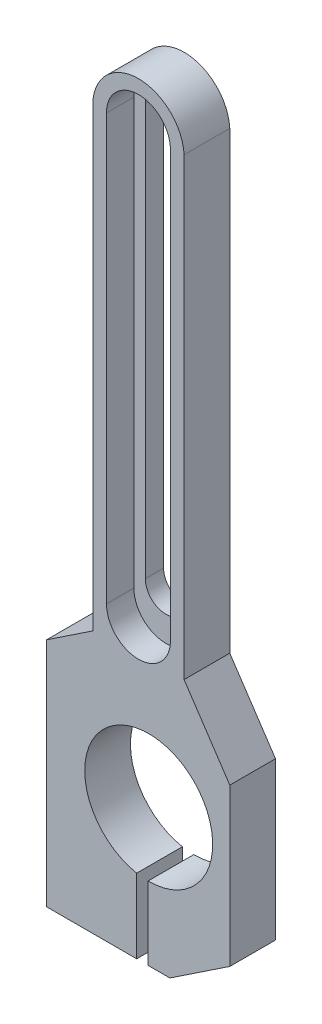
ISO-10303-21;
HEADER;
FILE_DESCRIPTION(('STEP AP214'),'2;1');
FILE_NAME('part.step','',(''),(''),'','','');
FILE_SCHEMA(('AUTOMOTIVE_DESIGN { 1 0 10303 214 1 1 1 1 }'));
ENDSEC;
DATA;
#1=APPLICATION_CONTEXT('core data for automotive mechanical design processes');
#2=APPLICATION_PROTOCOL_DEFINITION('international standard','automotive_design',2000,#1);
#3=PRODUCT_CONTEXT('',#1,'mechanical');
#4=PRODUCT('Part','Part','',(#3));
#5=PRODUCT_RELATED_PRODUCT_CATEGORY('part','',(#4));
#6=PRODUCT_DEFINITION_FORMATION('','',#4);
#7=PRODUCT_DEFINITION_CONTEXT('part definition',#1,'design');
#8=PRODUCT_DEFINITION('design','',#6,#7);
#9=PRODUCT_DEFINITION_SHAPE('','',#8);
#10=(LENGTH_UNIT() NAMED_UNIT(*) SI_UNIT(.MILLI.,.METRE.));
#11=(NAMED_UNIT(*) PLANE_ANGLE_UNIT() SI_UNIT($,.RADIAN.));
#12=(NAMED_UNIT(*) SI_UNIT($,.STERADIAN.) SOLID_ANGLE_UNIT());
#13=UNCERTAINTY_MEASURE_WITH_UNIT(LENGTH_MEASURE(1.E-05),#10,'distance_accuracy_value','');
#14=(GEOMETRIC_REPRESENTATION_CONTEXT(3) GLOBAL_UNCERTAINTY_ASSIGNED_CONTEXT((#13)) GLOBAL_UNIT_ASSIGNED_CONTEXT((#10,
#11,#12)) REPRESENTATION_CONTEXT('',''));
#15=CARTESIAN_POINT('',(0.,0.,0.));
#16=DIRECTION('',(0.,0.,1.));
#17=DIRECTION('',(1.,0.,0.));
#18=AXIS2_PLACEMENT_3D('',#15,#16,#17);
#19=CARTESIAN_POINT('',(-3.67997718197373,-54.5349544071179,10.));
#20=DIRECTION('',(0.,1.,0.));
#21=DIRECTION('',(0.,0.,1.));
#22=AXIS2_PLACEMENT_3D('',#19,#20,#21);
#23=PLANE('',#22);
#24=DIRECTION('',(1.,0.,0.));
#25=VECTOR('',#24,1.);
#26=CARTESIAN_POINT('',(-22.3649387441576,-54.5349544071179,10.));
#27=LINE('',#26,#25);
#28=CARTESIAN_POINT('',(-0.142672818562061,-54.5349544071179,10.));
#29=VERTEX_POINT('',#28);
#30=CARTESIAN_POINT('',(4.62817072668689,-54.5349544071179,10.));
#31=VERTEX_POINT('',#30);
#32=EDGE_CURVE('E193',#29,#31,#27,.T.);
#33=ORIENTED_EDGE('',*,*,#32,.F.);
#34=DIRECTION('',(0.,0.,-1.));
#35=VECTOR('',#34,1.);
#36=CARTESIAN_POINT('',(-0.142672818562061,-54.5349544071179,10.));
#37=LINE('',#36,#35);
#38=CARTESIAN_POINT('',(-0.142672818562061,-54.5349544071179,0.));
#39=VERTEX_POINT('',#38);
#40=EDGE_CURVE('E180',#29,#39,#37,.T.);
#41=ORIENTED_EDGE('',*,*,#40,.T.);
#42=DIRECTION('',(1.,0.,0.));
#43=VECTOR('',#42,1.);
#44=CARTESIAN_POINT('',(-3.67997718197373,-54.5349544071179,0.));
#45=LINE('',#44,#43);
#46=CARTESIAN_POINT('',(4.62817072668689,-54.5349544071179,0.));
#47=VERTEX_POINT('',#46);
#48=EDGE_CURVE('E247',#39,#47,#45,.T.);
#49=ORIENTED_EDGE('',*,*,#48,.T.);
#50=DIRECTION('',(0.,0.,-1.));
#51=VECTOR('',#50,1.);
#52=CARTESIAN_POINT('',(4.62817072668689,-54.5349544071179,10.));
#53=LINE('',#52,#51);
#54=EDGE_CURVE('E201',#31,#47,#53,.T.);
#55=ORIENTED_EDGE('',*,*,#54,.F.);
#56=EDGE_LOOP('',(#33,#41,#49,#55));
#57=FACE_BOUND('',#56,.T.);
#58=ADVANCED_FACE('F39',(#57),#23,.F.);
#59=CARTESIAN_POINT('',(-2.24292189812462,102.465045592882,10.));
#60=DIRECTION('',(0.,0.,-1.));
#61=DIRECTION('',(-1.,0.,0.));
#62=AXIS2_PLACEMENT_3D('',#59,#60,#61);
#63=CYLINDRICAL_SURFACE('',#62,4.5);
#64=DIRECTION('',(0.,0.,-1.));
#65=VECTOR('',#64,1.);
#66=CARTESIAN_POINT('',(2.25707810187538,102.465045592882,10.));
#67=LINE('',#66,#65);
#68=CARTESIAN_POINT('',(2.25707810187538,102.465045592882,4.));
#69=VERTEX_POINT('',#68);
#70=CARTESIAN_POINT('',(2.25707810187538,102.465045592882,0.));
#71=VERTEX_POINT('',#70);
#72=EDGE_CURVE('E397',#69,#71,#67,.T.);
#73=ORIENTED_EDGE('',*,*,#72,.F.);
#74=CARTESIAN_POINT('',(-2.24292189812462,102.465045592882,4.));
#75=DIRECTION('',(0.,0.,1.));
#76=DIRECTION('',(1.,0.,0.));
#77=AXIS2_PLACEMENT_3D('',#74,#75,#76);
#78=CIRCLE('',#77,4.5);
#79=CARTESIAN_POINT('',(-6.74292189812462,102.465045592882,4.));
#80=VERTEX_POINT('',#79);
#81=EDGE_CURVE('E377',#69,#80,#78,.T.);
#82=ORIENTED_EDGE('',*,*,#81,.T.);
#83=DIRECTION('',(0.,0.,-1.));
#84=VECTOR('',#83,1.);
#85=CARTESIAN_POINT('',(-6.74292189812462,102.465045592882,10.));
#86=LINE('',#85,#84);
#87=CARTESIAN_POINT('',(-6.74292189812462,102.465045592882,0.));
#88=VERTEX_POINT('',#87);
#89=EDGE_CURVE('E216',#80,#88,#86,.T.);
#90=ORIENTED_EDGE('',*,*,#89,.T.);
#91=CARTESIAN_POINT('',(-2.24292189812462,102.465045592882,0.));
#92=DIRECTION('',(0.,0.,1.));
#93=DIRECTION('',(1.,0.,0.));
#94=AXIS2_PLACEMENT_3D('',#91,#92,#93);
#95=CIRCLE('',#94,4.5);
#96=EDGE_CURVE('E381',#71,#88,#95,.T.);
#97=ORIENTED_EDGE('',*,*,#96,.F.);
#98=EDGE_LOOP('',(#73,#82,#90,#97));
#99=FACE_BOUND('',#98,.T.);
#100=ADVANCED_FACE('F467',(#99),#63,.F.);
#101=CARTESIAN_POINT('',(-6.74292189812462,102.465045592882,10.));
#102=DIRECTION('',(1.,0.,0.));
#103=DIRECTION('',(0.,0.,-1.));
#104=AXIS2_PLACEMENT_3D('',#101,#102,#103);
#105=PLANE('',#104);
#106=ORIENTED_EDGE('',*,*,#89,.F.);
#107=DIRECTION('',(0.,-1.,0.));
#108=VECTOR('',#107,1.);
#109=CARTESIAN_POINT('',(-6.74292189812462,102.465045592882,4.));
#110=LINE('',#109,#108);
#111=CARTESIAN_POINT('',(-6.74292189812462,12.4650455928821,4.));
#112=VERTEX_POINT('',#111);
#113=EDGE_CURVE('E373',#80,#112,#110,.T.);
#114=ORIENTED_EDGE('',*,*,#113,.T.);
#115=DIRECTION('',(0.,0.,-1.));
#116=VECTOR('',#115,1.);
#117=CARTESIAN_POINT('',(-6.74292189812462,12.4650455928821,10.));
#118=LINE('',#117,#116);
#119=CARTESIAN_POINT('',(-6.74292189812462,12.4650455928821,0.));
#120=VERTEX_POINT('',#119);
#121=EDGE_CURVE('E402',#112,#120,#118,.T.);
#122=ORIENTED_EDGE('',*,*,#121,.T.);
#123=DIRECTION('',(0.,-1.,0.));
#124=VECTOR('',#123,1.);
#125=CARTESIAN_POINT('',(-6.74292189812462,102.465045592882,0.));
#126=LINE('',#125,#124);
#127=EDGE_CURVE('E385',#88,#120,#126,.T.);
#128=ORIENTED_EDGE('',*,*,#127,.F.);
#129=EDGE_LOOP('',(#106,#114,#122,#128));
#130=FACE_BOUND('',#129,.T.);
#131=ADVANCED_FACE('F471',(#130),#105,.T.);
#132=CARTESIAN_POINT('',(-2.24292189812462,12.4650455928821,10.));
#133=DIRECTION('',(0.,0.,-1.));
#134=DIRECTION('',(-1.,0.,0.));
#135=AXIS2_PLACEMENT_3D('',#132,#133,#134);
#136=CYLINDRICAL_SURFACE('',#135,4.5);
#137=ORIENTED_EDGE('',*,*,#121,.F.);
#138=CARTESIAN_POINT('',(-2.24292189812462,12.4650455928821,4.));
#139=DIRECTION('',(0.,0.,1.));
#140=DIRECTION('',(1.,0.,0.));
#141=AXIS2_PLACEMENT_3D('',#138,#139,#140);
#142=CIRCLE('',#141,4.5);
#143=CARTESIAN_POINT('',(2.25707810187538,12.4650455928821,4.));
#144=VERTEX_POINT('',#143);
#145=EDGE_CURVE('E360',#112,#144,#142,.T.);
#146=ORIENTED_EDGE('',*,*,#145,.T.);
#147=DIRECTION('',(0.,0.,-1.));
#148=VECTOR('',#147,1.);
#149=CARTESIAN_POINT('',(2.25707810187538,12.4650455928821,10.));
#150=LINE('',#149,#148);
#151=CARTESIAN_POINT('',(2.25707810187538,12.4650455928821,0.));
#152=VERTEX_POINT('',#151);
#153=EDGE_CURVE('E400',#144,#152,#150,.T.);
#154=ORIENTED_EDGE('',*,*,#153,.T.);
#155=CARTESIAN_POINT('',(-2.24292189812462,12.4650455928821,0.));
#156=DIRECTION('',(0.,0.,1.));
#157=DIRECTION('',(1.,0.,0.));
#158=AXIS2_PLACEMENT_3D('',#155,#156,#157);
#159=CIRCLE('',#158,4.5);
#160=EDGE_CURVE('E389',#120,#152,#159,.T.);
#161=ORIENTED_EDGE('',*,*,#160,.F.);
#162=EDGE_LOOP('',(#137,#146,#154,#161));
#163=FACE_BOUND('',#162,.T.);
#164=ADVANCED_FACE('F633',(#163),#136,.F.);
#165=CARTESIAN_POINT('',(2.25707810187538,102.465045592882,10.));
#166=DIRECTION('',(-1.,0.,0.));
#167=DIRECTION('',(0.,0.,1.));
#168=AXIS2_PLACEMENT_3D('',#165,#166,#167);
#169=PLANE('',#168);
#170=ORIENTED_EDGE('',*,*,#153,.F.);
#171=DIRECTION('',(0.,1.,0.));
#172=VECTOR('',#171,1.);
#173=CARTESIAN_POINT('',(2.25707810187538,102.465045592882,4.));
#174=LINE('',#173,#172);
#175=EDGE_CURVE('E300',#144,#69,#174,.T.);
#176=ORIENTED_EDGE('',*,*,#175,.T.);
#177=ORIENTED_EDGE('',*,*,#72,.T.);
#178=DIRECTION('',(0.,1.,0.));
#179=VECTOR('',#178,1.);
#180=CARTESIAN_POINT('',(2.25707810187538,102.465045592882,0.));
#181=LINE('',#180,#179);
#182=EDGE_CURVE('E393',#152,#71,#181,.T.);
#183=ORIENTED_EDGE('',*,*,#182,.F.);
#184=EDGE_LOOP('',(#170,#176,#177,#183));
#185=FACE_BOUND('',#184,.T.);
#186=ADVANCED_FACE('F482',(#185),#169,.T.);
#187=CARTESIAN_POINT('',(-2.24292189812462,102.465045592882,10.));
#188=DIRECTION('',(0.,0.,-1.));
#189=DIRECTION('',(-1.,0.,0.));
#190=AXIS2_PLACEMENT_3D('',#187,#188,#189);
#191=PLANE('',#190);
#192=DIRECTION('',(0.,-1.,0.));
#193=VECTOR('',#192,1.);
#194=CARTESIAN_POINT('',(-9.24292189812461,102.465045592882,10.));
#195=LINE('',#194,#193);
#196=CARTESIAN_POINT('',(-9.24292189812461,102.465045592882,10.));
#197=VERTEX_POINT('',#196);
#198=CARTESIAN_POINT('',(-9.2429218981246,9.4302624073018,10.));
#199=VERTEX_POINT('',#198);
#200=EDGE_CURVE('E346',#197,#199,#195,.T.);
#201=ORIENTED_EDGE('',*,*,#200,.F.);
#202=CARTESIAN_POINT('',(-2.24292189812462,102.465045592882,10.));
#203=DIRECTION('',(0.,0.,1.));
#204=DIRECTION('',(1.,0.,0.));
#205=AXIS2_PLACEMENT_3D('',#202,#203,#204);
#206=CIRCLE('',#205,7.);
#207=CARTESIAN_POINT('',(4.75707810187538,102.465045592882,10.));
#208=VERTEX_POINT('',#207);
#209=EDGE_CURVE('E307',#208,#197,#206,.T.);
#210=ORIENTED_EDGE('',*,*,#209,.F.);
#211=DIRECTION('',(0.,1.,0.));
#212=VECTOR('',#211,1.);
#213=CARTESIAN_POINT('',(4.75707810187538,102.465045592882,10.));
#214=LINE('',#213,#212);
#215=CARTESIAN_POINT('',(4.75707810187539,9.4302624073018,10.));
#216=VERTEX_POINT('',#215);
#217=EDGE_CURVE('E331',#216,#208,#214,.T.);
#218=ORIENTED_EDGE('',*,*,#217,.F.);
#219=CARTESIAN_POINT('',(-2.2429218981246,9.4302624073018,10.));
#220=DIRECTION('',(0.,0.,1.));
#221=DIRECTION('',(1.,0.,0.));
#222=AXIS2_PLACEMENT_3D('',#219,#220,#221);
#223=CIRCLE('',#222,7.);
#224=EDGE_CURVE('E350',#199,#216,#223,.T.);
#225=ORIENTED_EDGE('',*,*,#224,.F.);
#226=EDGE_LOOP('',(#201,#210,#218,#225));
#227=FACE_BOUND('',#226,.T.);
#228=CARTESIAN_POINT('',(0.,-24.5349544071179,10.));
#229=DIRECTION('',(0.,0.,1.));
#230=DIRECTION('',(1.,0.,0.));
#231=AXIS2_PLACEMENT_3D('',#228,#229,#230);
#232=CIRCLE('',#231,14.);
#233=CARTESIAN_POINT('',(-0.142672818562063,-38.5342274049147,10.));
#234=VERTEX_POINT('',#233);
#235=CARTESIAN_POINT('',(-2.62812903575238,-38.2860611906257,9.99999999999999));
#236=VERTEX_POINT('',#235);
#237=EDGE_CURVE('E188',#234,#236,#232,.T.);
#238=ORIENTED_EDGE('',*,*,#237,.F.);
#239=DIRECTION('',(0.,1.,0.));
#240=VECTOR('',#239,1.);
#241=CARTESIAN_POINT('',(-0.142672818562064,-26.2084810434457,10.));
#242=LINE('',#241,#240);
#243=EDGE_CURVE('E55',#29,#234,#242,.T.);
#244=ORIENTED_EDGE('',*,*,#243,.F.);
#245=ORIENTED_EDGE('',*,*,#32,.T.);
#246=DIRECTION('',(0.832050294337843,0.554700196225229,0.));
#247=VECTOR('',#246,1.);
#248=CARTESIAN_POINT('',(4.62817072668689,-54.5349544071179,10.));
#249=LINE('',#248,#247);
#250=CARTESIAN_POINT('',(17.7413928210685,-45.7928063441968,10.));
#251=VERTEX_POINT('',#250);
#252=EDGE_CURVE('E210',#31,#251,#249,.T.);
#253=ORIENTED_EDGE('',*,*,#252,.T.);
#254=DIRECTION('',(0.,1.,0.));
#255=VECTOR('',#254,1.);
#256=CARTESIAN_POINT('',(17.7413928210685,-45.7928063441968,10.));
#257=LINE('',#256,#255);
#258=CARTESIAN_POINT('',(17.7413928210685,-11.4273322513809,10.));
#259=VERTEX_POINT('',#258);
#260=EDGE_CURVE('E220',#251,#259,#257,.T.);
#261=ORIENTED_EDGE('',*,*,#260,.T.);
#262=DIRECTION('',(-0.554700196225229,0.832050294337844,0.));
#263=VECTOR('',#262,1.);
#264=CARTESIAN_POINT('',(17.7413928210685,-11.4273322513809,10.));
#265=LINE('',#264,#263);
#266=CARTESIAN_POINT('',(7.74139282106854,3.57266774861913,10.));
#267=VERTEX_POINT('',#266);
#268=EDGE_CURVE('E223',#259,#267,#265,.T.);
#269=ORIENTED_EDGE('',*,*,#268,.T.);
#270=DIRECTION('',(0.,1.,0.));
#271=VECTOR('',#270,1.);
#272=CARTESIAN_POINT('',(7.74139282106854,3.57266774861913,10.));
#273=LINE('',#272,#271);
#274=CARTESIAN_POINT('',(7.74139282106854,103.024920211081,10.));
#275=VERTEX_POINT('',#274);
#276=EDGE_CURVE('E226',#267,#275,#273,.T.);
#277=ORIENTED_EDGE('',*,*,#276,.T.);
#278=CARTESIAN_POINT('',(-2.24292189812462,102.465045592882,10.));
#279=DIRECTION('',(0.,0.,1.));
#280=DIRECTION('',(-1.,0.,0.));
#281=AXIS2_PLACEMENT_3D('',#278,#279,#280);
#282=CIRCLE('',#281,10.);
#283=CARTESIAN_POINT('',(-12.2420598243025,102.596349565676,10.));
#284=VERTEX_POINT('',#283);
#285=EDGE_CURVE('E229',#275,#284,#282,.T.);
#286=ORIENTED_EDGE('',*,*,#285,.T.);
#287=DIRECTION('',(0.,-1.,0.));
#288=VECTOR('',#287,1.);
#289=CARTESIAN_POINT('',(-12.2420598243025,102.596349565676,10.));
#290=LINE('',#289,#288);
#291=CARTESIAN_POINT('',(-12.2420598243025,2.80428443948169,10.));
#292=VERTEX_POINT('',#291);
#293=EDGE_CURVE('E232',#284,#292,#290,.T.);
#294=ORIENTED_EDGE('',*,*,#293,.T.);
#295=DIRECTION('',(-0.832050294337843,-0.554700196225229,0.));
#296=VECTOR('',#295,1.);
#297=CARTESIAN_POINT('',(-12.2420598243025,2.80428443948169,10.));
#298=LINE('',#297,#296);
#299=CARTESIAN_POINT('',(-22.3649387441577,-3.94430150708844,10.));
#300=VERTEX_POINT('',#299);
#301=EDGE_CURVE('E235',#292,#300,#298,.T.);
#302=ORIENTED_EDGE('',*,*,#301,.T.);
#303=DIRECTION('',(0.,-1.,0.));
#304=VECTOR('',#303,1.);
#305=CARTESIAN_POINT('',(-22.3649387441577,-3.94430150708844,10.));
#306=LINE('',#305,#304);
#307=CARTESIAN_POINT('',(-22.3649387441576,-54.5349544071179,10.));
#308=VERTEX_POINT('',#307);
#309=EDGE_CURVE('E238',#300,#308,#306,.T.);
#310=ORIENTED_EDGE('',*,*,#309,.T.);
#311=CARTESIAN_POINT('',(-2.62812903575238,-54.5349544071179,10.));
#312=VERTEX_POINT('',#311);
#313=EDGE_CURVE('E204',#308,#312,#27,.T.);
#314=ORIENTED_EDGE('',*,*,#313,.T.);
#315=DIRECTION('',(0.,-1.,0.));
#316=VECTOR('',#315,1.);
#317=CARTESIAN_POINT('',(-2.62812903575238,-26.2084810434457,10.));
#318=LINE('',#317,#316);
#319=EDGE_CURVE('E198',#236,#312,#318,.T.);
#320=ORIENTED_EDGE('',*,*,#319,.F.);
#321=EDGE_LOOP('',(#238,#244,#245,#253,#261,#269,#277,#286,#294,#302,#310,#314,#320));
#322=FACE_BOUND('',#321,.T.);
#323=ADVANCED_FACE('F192',(#227,#322),#191,.F.);
#324=CARTESIAN_POINT('',(-2.24292189812462,102.465045592882,0.));
#325=DIRECTION('',(0.,0.,-1.));
#326=DIRECTION('',(-1.,0.,0.));
#327=AXIS2_PLACEMENT_3D('',#324,#325,#326);
#328=PLANE('',#327);
#329=DIRECTION('',(0.,-1.,0.));
#330=VECTOR('',#329,1.);
#331=CARTESIAN_POINT('',(-0.142672818562079,102.465045592882,0.));
#332=LINE('',#331,#330);
#333=CARTESIAN_POINT('',(-0.142672818562063,-38.5342274049147,0.));
#334=VERTEX_POINT('',#333);
#335=EDGE_CURVE('E183',#334,#39,#332,.T.);
#336=ORIENTED_EDGE('',*,*,#335,.F.);
#337=CARTESIAN_POINT('',(0.,-24.5349544071179,0.));
#338=DIRECTION('',(0.,0.,-1.));
#339=DIRECTION('',(-1.,0.,0.));
#340=AXIS2_PLACEMENT_3D('',#337,#338,#339);
#341=CIRCLE('',#340,14.);
#342=CARTESIAN_POINT('',(-2.62812903575238,-38.2860611906257,0.));
#343=VERTEX_POINT('',#342);
#344=EDGE_CURVE('E304',#343,#334,#341,.T.);
#345=ORIENTED_EDGE('',*,*,#344,.F.);
#346=DIRECTION('',(0.,1.,0.));
#347=VECTOR('',#346,1.);
#348=CARTESIAN_POINT('',(-2.6281290357524,102.465045592882,0.));
#349=LINE('',#348,#347);
#350=CARTESIAN_POINT('',(-2.62812903575238,-54.5349544071179,0.));
#351=VERTEX_POINT('',#350);
#352=EDGE_CURVE('E62',#351,#343,#349,.T.);
#353=ORIENTED_EDGE('',*,*,#352,.F.);
#354=CARTESIAN_POINT('',(-22.3649387441576,-54.5349544071179,0.));
#355=VERTEX_POINT('',#354);
#356=EDGE_CURVE('E242',#355,#351,#45,.T.);
#357=ORIENTED_EDGE('',*,*,#356,.F.);
#358=DIRECTION('',(0.,-1.,0.));
#359=VECTOR('',#358,1.);
#360=CARTESIAN_POINT('',(-22.3649387441577,-3.94430150708844,0.));
#361=LINE('',#360,#359);
#362=CARTESIAN_POINT('',(-22.3649387441577,-3.94430150708844,0.));
#363=VERTEX_POINT('',#362);
#364=EDGE_CURVE('E205',#363,#355,#361,.T.);
#365=ORIENTED_EDGE('',*,*,#364,.F.);
#366=DIRECTION('',(-0.832050294337843,-0.554700196225229,0.));
#367=VECTOR('',#366,1.);
#368=CARTESIAN_POINT('',(-12.2420598243025,2.80428443948169,0.));
#369=LINE('',#368,#367);
#370=CARTESIAN_POINT('',(-12.2420598243025,2.80428443948169,0.));
#371=VERTEX_POINT('',#370);
#372=EDGE_CURVE('E212',#371,#363,#369,.T.);
#373=ORIENTED_EDGE('',*,*,#372,.F.);
#374=DIRECTION('',(0.,-1.,0.));
#375=VECTOR('',#374,1.);
#376=CARTESIAN_POINT('',(-12.2420598243025,102.596349565676,0.));
#377=LINE('',#376,#375);
#378=CARTESIAN_POINT('',(-12.2420598243025,102.596349565676,0.));
#379=VERTEX_POINT('',#378);
#380=EDGE_CURVE('E262',#379,#371,#377,.T.);
#381=ORIENTED_EDGE('',*,*,#380,.F.);
#382=CARTESIAN_POINT('',(-2.24292189812462,102.465045592882,0.));
#383=DIRECTION('',(0.,0.,1.));
#384=DIRECTION('',(-1.,0.,0.));
#385=AXIS2_PLACEMENT_3D('',#382,#383,#384);
#386=CIRCLE('',#385,10.);
#387=CARTESIAN_POINT('',(7.74139282106854,103.024920211081,0.));
#388=VERTEX_POINT('',#387);
#389=EDGE_CURVE('E259',#388,#379,#386,.T.);
#390=ORIENTED_EDGE('',*,*,#389,.F.);
#391=DIRECTION('',(0.,1.,0.));
#392=VECTOR('',#391,1.);
#393=CARTESIAN_POINT('',(7.74139282106854,3.57266774861913,0.));
#394=LINE('',#393,#392);
#395=CARTESIAN_POINT('',(7.74139282106854,3.57266774861913,0.));
#396=VERTEX_POINT('',#395);
#397=EDGE_CURVE('E256',#396,#388,#394,.T.);
#398=ORIENTED_EDGE('',*,*,#397,.F.);
#399=DIRECTION('',(-0.554700196225229,0.832050294337844,0.));
#400=VECTOR('',#399,1.);
#401=CARTESIAN_POINT('',(17.7413928210685,-11.4273322513809,0.));
#402=LINE('',#401,#400);
#403=CARTESIAN_POINT('',(17.7413928210685,-11.4273322513809,0.));
#404=VERTEX_POINT('',#403);
#405=EDGE_CURVE('E253',#404,#396,#402,.T.);
#406=ORIENTED_EDGE('',*,*,#405,.F.);
#407=DIRECTION('',(0.,1.,0.));
#408=VECTOR('',#407,1.);
#409=CARTESIAN_POINT('',(17.7413928210685,-45.7928063441968,0.));
#410=LINE('',#409,#408);
#411=CARTESIAN_POINT('',(17.7413928210685,-45.7928063441968,0.));
#412=VERTEX_POINT('',#411);
#413=EDGE_CURVE('E250',#412,#404,#410,.T.);
#414=ORIENTED_EDGE('',*,*,#413,.F.);
#415=DIRECTION('',(0.832050294337843,0.554700196225229,0.));
#416=VECTOR('',#415,1.);
#417=CARTESIAN_POINT('',(4.62817072668689,-54.5349544071179,0.));
#418=LINE('',#417,#416);
#419=EDGE_CURVE('E246',#47,#412,#418,.T.);
#420=ORIENTED_EDGE('',*,*,#419,.F.);
#421=ORIENTED_EDGE('',*,*,#48,.F.);
#422=EDGE_LOOP('',(#336,#345,#353,#357,#365,#373,#381,#390,#398,#406,#414,#420,#421));
#423=FACE_BOUND('',#422,.T.);
#424=ORIENTED_EDGE('',*,*,#182,.T.);
#425=ORIENTED_EDGE('',*,*,#96,.T.);
#426=ORIENTED_EDGE('',*,*,#127,.T.);
#427=ORIENTED_EDGE('',*,*,#160,.T.);
#428=EDGE_LOOP('',(#424,#425,#426,#427));
#429=FACE_BOUND('',#428,.T.);
#430=ADVANCED_FACE('F313',(#423,#429),#328,.T.);
#431=ORIENTED_EDGE('',*,*,#356,.T.);
#432=DIRECTION('',(0.,0.,1.));
#433=VECTOR('',#432,1.);
#434=CARTESIAN_POINT('',(-2.62812903575238,-54.5349544071179,10.));
#435=LINE('',#434,#433);
#436=EDGE_CURVE('E317',#351,#312,#435,.T.);
#437=ORIENTED_EDGE('',*,*,#436,.T.);
#438=ORIENTED_EDGE('',*,*,#313,.F.);
#439=DIRECTION('',(0.,0.,-1.));
#440=VECTOR('',#439,1.);
#441=CARTESIAN_POINT('',(-22.3649387441576,-54.5349544071179,10.));
#442=LINE('',#441,#440);
#443=EDGE_CURVE('E241',#308,#355,#442,.T.);
#444=ORIENTED_EDGE('',*,*,#443,.T.);
#445=EDGE_LOOP('',(#431,#437,#438,#444));
#446=FACE_BOUND('',#445,.T.);
#447=ADVANCED_FACE('F41',(#446),#23,.F.);
#448=CARTESIAN_POINT('',(4.62817072668689,-54.5349544071179,10.));
#449=DIRECTION('',(-0.554700196225229,0.832050294337843,0.));
#450=DIRECTION('',(-0.832050294337843,-0.554700196225229,0.));
#451=AXIS2_PLACEMENT_3D('',#448,#449,#450);
#452=PLANE('',#451);
#453=ORIENTED_EDGE('',*,*,#419,.T.);
#454=DIRECTION('',(0.,0.,-1.));
#455=VECTOR('',#454,1.);
#456=CARTESIAN_POINT('',(17.7413928210685,-45.7928063441968,10.));
#457=LINE('',#456,#455);
#458=EDGE_CURVE('E294',#251,#412,#457,.T.);
#459=ORIENTED_EDGE('',*,*,#458,.F.);
#460=ORIENTED_EDGE('',*,*,#252,.F.);
#461=ORIENTED_EDGE('',*,*,#54,.T.);
#462=EDGE_LOOP('',(#453,#459,#460,#461));
#463=FACE_BOUND('',#462,.T.);
#464=ADVANCED_FACE('F414',(#463),#452,.F.);
#465=CARTESIAN_POINT('',(17.7413928210685,-45.7928063441968,10.));
#466=DIRECTION('',(-1.,0.,0.));
#467=DIRECTION('',(0.,0.,1.));
#468=AXIS2_PLACEMENT_3D('',#465,#466,#467);
#469=PLANE('',#468);
#470=ORIENTED_EDGE('',*,*,#413,.T.);
#471=DIRECTION('',(0.,0.,-1.));
#472=VECTOR('',#471,1.);
#473=CARTESIAN_POINT('',(17.7413928210685,-11.4273322513809,10.));
#474=LINE('',#473,#472);
#475=EDGE_CURVE('E290',#259,#404,#474,.T.);
#476=ORIENTED_EDGE('',*,*,#475,.F.);
#477=ORIENTED_EDGE('',*,*,#260,.F.);
#478=ORIENTED_EDGE('',*,*,#458,.T.);
#479=EDGE_LOOP('',(#470,#476,#477,#478));
#480=FACE_BOUND('',#479,.T.);
#481=ADVANCED_FACE('F421',(#480),#469,.F.);
#482=CARTESIAN_POINT('',(17.7413928210685,-11.4273322513809,10.));
#483=DIRECTION('',(-0.832050294337844,-0.554700196225229,0.));
#484=DIRECTION('',(0.554700196225229,-0.832050294337844,0.));
#485=AXIS2_PLACEMENT_3D('',#482,#483,#484);
#486=PLANE('',#485);
#487=ORIENTED_EDGE('',*,*,#405,.T.);
#488=DIRECTION('',(0.,0.,-1.));
#489=VECTOR('',#488,1.);
#490=CARTESIAN_POINT('',(7.74139282106854,3.57266774861913,10.));
#491=LINE('',#490,#489);
#492=EDGE_CURVE('E286',#267,#396,#491,.T.);
#493=ORIENTED_EDGE('',*,*,#492,.F.);
#494=ORIENTED_EDGE('',*,*,#268,.F.);
#495=ORIENTED_EDGE('',*,*,#475,.T.);
#496=EDGE_LOOP('',(#487,#493,#494,#495));
#497=FACE_BOUND('',#496,.T.);
#498=ADVANCED_FACE('F425',(#497),#486,.F.);
#499=CARTESIAN_POINT('',(7.74139282106854,3.57266774861913,10.));
#500=DIRECTION('',(-1.,0.,0.));
#501=DIRECTION('',(0.,0.,1.));
#502=AXIS2_PLACEMENT_3D('',#499,#500,#501);
#503=PLANE('',#502);
#504=ORIENTED_EDGE('',*,*,#397,.T.);
#505=DIRECTION('',(0.,0.,-1.));
#506=VECTOR('',#505,1.);
#507=CARTESIAN_POINT('',(7.74139282106854,103.024920211081,10.));
#508=LINE('',#507,#506);
#509=EDGE_CURVE('E282',#275,#388,#508,.T.);
#510=ORIENTED_EDGE('',*,*,#509,.F.);
#511=ORIENTED_EDGE('',*,*,#276,.F.);
#512=ORIENTED_EDGE('',*,*,#492,.T.);
#513=EDGE_LOOP('',(#504,#510,#511,#512));
#514=FACE_BOUND('',#513,.T.);
#515=ADVANCED_FACE('F432',(#514),#503,.F.);
#516=CARTESIAN_POINT('',(-2.24292189812462,102.465045592882,10.));
#517=DIRECTION('',(0.,0.,-1.));
#518=DIRECTION('',(-1.,0.,0.));
#519=AXIS2_PLACEMENT_3D('',#516,#517,#518);
#520=CYLINDRICAL_SURFACE('',#519,10.);
#521=ORIENTED_EDGE('',*,*,#389,.T.);
#522=DIRECTION('',(0.,0.,-1.));
#523=VECTOR('',#522,1.);
#524=CARTESIAN_POINT('',(-12.2420598243025,102.596349565676,10.));
#525=LINE('',#524,#523);
#526=EDGE_CURVE('E278',#284,#379,#525,.T.);
#527=ORIENTED_EDGE('',*,*,#526,.F.);
#528=ORIENTED_EDGE('',*,*,#285,.F.);
#529=ORIENTED_EDGE('',*,*,#509,.T.);
#530=EDGE_LOOP('',(#521,#527,#528,#529));
#531=FACE_BOUND('',#530,.T.);
#532=ADVANCED_FACE('F435',(#531),#520,.T.);
#533=CARTESIAN_POINT('',(-12.2420598243025,102.596349565676,10.));
#534=DIRECTION('',(1.,0.,0.));
#535=DIRECTION('',(0.,1.,0.));
#536=AXIS2_PLACEMENT_3D('',#533,#534,#535);
#537=PLANE('',#536);
#538=ORIENTED_EDGE('',*,*,#380,.T.);
#539=DIRECTION('',(0.,0.,-1.));
#540=VECTOR('',#539,1.);
#541=CARTESIAN_POINT('',(-12.2420598243025,2.80428443948169,10.));
#542=LINE('',#541,#540);
#543=EDGE_CURVE('E274',#292,#371,#542,.T.);
#544=ORIENTED_EDGE('',*,*,#543,.F.);
#545=ORIENTED_EDGE('',*,*,#293,.F.);
#546=ORIENTED_EDGE('',*,*,#526,.T.);
#547=EDGE_LOOP('',(#538,#544,#545,#546));
#548=FACE_BOUND('',#547,.T.);
#549=ADVANCED_FACE('F440',(#548),#537,.F.);
#550=CARTESIAN_POINT('',(-12.2420598243025,2.80428443948169,10.));
#551=DIRECTION('',(0.554700196225229,-0.832050294337843,0.));
#552=DIRECTION('',(0.832050294337843,0.554700196225229,0.));
#553=AXIS2_PLACEMENT_3D('',#550,#551,#552);
#554=PLANE('',#553);
#555=ORIENTED_EDGE('',*,*,#372,.T.);
#556=DIRECTION('',(0.,0.,-1.));
#557=VECTOR('',#556,1.);
#558=CARTESIAN_POINT('',(-22.3649387441577,-3.94430150708844,10.));
#559=LINE('',#558,#557);
#560=EDGE_CURVE('E270',#300,#363,#559,.T.);
#561=ORIENTED_EDGE('',*,*,#560,.F.);
#562=ORIENTED_EDGE('',*,*,#301,.F.);
#563=ORIENTED_EDGE('',*,*,#543,.T.);
#564=EDGE_LOOP('',(#555,#561,#562,#563));
#565=FACE_BOUND('',#564,.T.);
#566=ADVANCED_FACE('F446',(#565),#554,.F.);
#567=CARTESIAN_POINT('',(-22.3649387441577,-3.94430150708844,10.));
#568=DIRECTION('',(1.,0.,0.));
#569=DIRECTION('',(0.,1.,0.));
#570=AXIS2_PLACEMENT_3D('',#567,#568,#569);
#571=PLANE('',#570);
#572=ORIENTED_EDGE('',*,*,#364,.T.);
#573=ORIENTED_EDGE('',*,*,#443,.F.);
#574=ORIENTED_EDGE('',*,*,#309,.F.);
#575=ORIENTED_EDGE('',*,*,#560,.T.);
#576=EDGE_LOOP('',(#572,#573,#574,#575));
#577=FACE_BOUND('',#576,.T.);
#578=ADVANCED_FACE('F450',(#577),#571,.F.);
#579=CARTESIAN_POINT('',(-2.24292189812462,102.465045592882,4.));
#580=DIRECTION('',(0.,0.,1.));
#581=DIRECTION('',(1.,0.,0.));
#582=AXIS2_PLACEMENT_3D('',#579,#580,#581);
#583=CYLINDRICAL_SURFACE('',#582,7.);
#584=ORIENTED_EDGE('',*,*,#209,.T.);
#585=DIRECTION('',(0.,0.,1.));
#586=VECTOR('',#585,1.);
#587=CARTESIAN_POINT('',(-9.24292189812461,102.465045592882,4.));
#588=LINE('',#587,#586);
#589=CARTESIAN_POINT('',(-9.24292189812461,102.465045592882,4.));
#590=VERTEX_POINT('',#589);
#591=EDGE_CURVE('E343',#590,#197,#588,.T.);
#592=ORIENTED_EDGE('',*,*,#591,.F.);
#593=CARTESIAN_POINT('',(-2.24292189812462,102.465045592882,4.));
#594=DIRECTION('',(0.,0.,1.));
#595=DIRECTION('',(1.,0.,0.));
#596=AXIS2_PLACEMENT_3D('',#593,#594,#595);
#597=CIRCLE('',#596,7.);
#598=CARTESIAN_POINT('',(4.75707810187538,102.465045592882,4.));
#599=VERTEX_POINT('',#598);
#600=EDGE_CURVE('E326',#599,#590,#597,.T.);
#601=ORIENTED_EDGE('',*,*,#600,.F.);
#602=DIRECTION('',(0.,0.,1.));
#603=VECTOR('',#602,1.);
#604=CARTESIAN_POINT('',(4.75707810187538,102.465045592882,4.));
#605=LINE('',#604,#603);
#606=EDGE_CURVE('E357',#599,#208,#605,.T.);
#607=ORIENTED_EDGE('',*,*,#606,.T.);
#608=EDGE_LOOP('',(#584,#592,#601,#607));
#609=FACE_BOUND('',#608,.T.);
#610=ADVANCED_FACE('F488',(#609),#583,.F.);
#611=CARTESIAN_POINT('',(4.75707810187538,102.465045592882,4.));
#612=DIRECTION('',(1.,0.,0.));
#613=DIRECTION('',(0.,1.,0.));
#614=AXIS2_PLACEMENT_3D('',#611,#612,#613);
#615=PLANE('',#614);
#616=ORIENTED_EDGE('',*,*,#217,.T.);
#617=ORIENTED_EDGE('',*,*,#606,.F.);
#618=DIRECTION('',(0.,1.,0.));
#619=VECTOR('',#618,1.);
#620=CARTESIAN_POINT('',(4.75707810187538,102.465045592882,4.));
#621=LINE('',#620,#619);
#622=CARTESIAN_POINT('',(4.75707810187539,9.4302624073018,4.));
#623=VERTEX_POINT('',#622);
#624=EDGE_CURVE('E339',#623,#599,#621,.T.);
#625=ORIENTED_EDGE('',*,*,#624,.F.);
#626=DIRECTION('',(0.,0.,1.));
#627=VECTOR('',#626,1.);
#628=CARTESIAN_POINT('',(4.75707810187539,9.4302624073018,4.));
#629=LINE('',#628,#627);
#630=EDGE_CURVE('E361',#623,#216,#629,.T.);
#631=ORIENTED_EDGE('',*,*,#630,.T.);
#632=EDGE_LOOP('',(#616,#617,#625,#631));
#633=FACE_BOUND('',#632,.T.);
#634=ADVANCED_FACE('F535',(#633),#615,.F.);
#635=CARTESIAN_POINT('',(-2.2429218981246,9.4302624073018,4.));
#636=DIRECTION('',(0.,0.,1.));
#637=DIRECTION('',(1.,0.,0.));
#638=AXIS2_PLACEMENT_3D('',#635,#636,#637);
#639=CYLINDRICAL_SURFACE('',#638,7.);
#640=ORIENTED_EDGE('',*,*,#224,.T.);
#641=ORIENTED_EDGE('',*,*,#630,.F.);
#642=CARTESIAN_POINT('',(-2.2429218981246,9.4302624073018,4.));
#643=DIRECTION('',(0.,0.,1.));
#644=DIRECTION('',(1.,0.,0.));
#645=AXIS2_PLACEMENT_3D('',#642,#643,#644);
#646=CIRCLE('',#645,7.);
#647=CARTESIAN_POINT('',(-9.2429218981246,9.4302624073018,4.));
#648=VERTEX_POINT('',#647);
#649=EDGE_CURVE('E335',#648,#623,#646,.T.);
#650=ORIENTED_EDGE('',*,*,#649,.F.);
#651=DIRECTION('',(0.,0.,1.));
#652=VECTOR('',#651,1.);
#653=CARTESIAN_POINT('',(-9.2429218981246,9.4302624073018,4.));
#654=LINE('',#653,#652);
#655=EDGE_CURVE('E364',#648,#199,#654,.T.);
#656=ORIENTED_EDGE('',*,*,#655,.T.);
#657=EDGE_LOOP('',(#640,#641,#650,#656));
#658=FACE_BOUND('',#657,.T.);
#659=ADVANCED_FACE('F544',(#658),#639,.F.);
#660=CARTESIAN_POINT('',(-9.24292189812461,102.465045592882,4.));
#661=DIRECTION('',(-1.,0.,0.));
#662=DIRECTION('',(0.,-1.,0.));
#663=AXIS2_PLACEMENT_3D('',#660,#661,#662);
#664=PLANE('',#663);
#665=ORIENTED_EDGE('',*,*,#200,.T.);
#666=ORIENTED_EDGE('',*,*,#655,.F.);
#667=DIRECTION('',(0.,-1.,0.));
#668=VECTOR('',#667,1.);
#669=CARTESIAN_POINT('',(-9.24292189812461,102.465045592882,4.));
#670=LINE('',#669,#668);
#671=EDGE_CURVE('E330',#590,#648,#670,.T.);
#672=ORIENTED_EDGE('',*,*,#671,.F.);
#673=ORIENTED_EDGE('',*,*,#591,.T.);
#674=EDGE_LOOP('',(#665,#666,#672,#673));
#675=FACE_BOUND('',#674,.T.);
#676=ADVANCED_FACE('F552',(#675),#664,.F.);
#677=CARTESIAN_POINT('',(-2.24292189812462,102.465045592882,4.));
#678=DIRECTION('',(0.,0.,1.));
#679=DIRECTION('',(1.,0.,0.));
#680=AXIS2_PLACEMENT_3D('',#677,#678,#679);
#681=PLANE('',#680);
#682=ORIENTED_EDGE('',*,*,#175,.F.);
#683=ORIENTED_EDGE('',*,*,#145,.F.);
#684=ORIENTED_EDGE('',*,*,#113,.F.);
#685=ORIENTED_EDGE('',*,*,#81,.F.);
#686=EDGE_LOOP('',(#682,#683,#684,#685));
#687=FACE_BOUND('',#686,.T.);
#688=ORIENTED_EDGE('',*,*,#600,.T.);
#689=ORIENTED_EDGE('',*,*,#671,.T.);
#690=ORIENTED_EDGE('',*,*,#649,.T.);
#691=ORIENTED_EDGE('',*,*,#624,.T.);
#692=EDGE_LOOP('',(#688,#689,#690,#691));
#693=FACE_BOUND('',#692,.T.);
#694=ADVANCED_FACE('F464',(#687,#693),#681,.T.);
#695=CARTESIAN_POINT('',(0.,-24.5349544071179,-90.));
#696=DIRECTION('',(0.,0.,1.));
#697=DIRECTION('',(1.,0.,0.));
#698=AXIS2_PLACEMENT_3D('',#695,#696,#697);
#699=CYLINDRICAL_SURFACE('',#698,14.);
#700=ORIENTED_EDGE('',*,*,#344,.T.);
#701=DIRECTION('',(0.,0.,1.));
#702=VECTOR('',#701,1.);
#703=CARTESIAN_POINT('',(-0.142672818562063,-38.5342274049147,-90.));
#704=LINE('',#703,#702);
#705=EDGE_CURVE('E11',#334,#234,#704,.T.);
#706=ORIENTED_EDGE('',*,*,#705,.T.);
#707=ORIENTED_EDGE('',*,*,#237,.T.);
#708=DIRECTION('',(0.,0.,1.));
#709=VECTOR('',#708,1.);
#710=CARTESIAN_POINT('',(-2.62812903575238,-38.2860611906257,-90.));
#711=LINE('',#710,#709);
#712=EDGE_CURVE('E48',#236,#343,#711,.F.);
#713=ORIENTED_EDGE('',*,*,#712,.T.);
#714=EDGE_LOOP('',(#700,#706,#707,#713));
#715=FACE_BOUND('',#714,.T.);
#716=ADVANCED_FACE('F311',(#715),#699,.F.);
#717=CARTESIAN_POINT('',(-2.62812903575238,-26.2084810434457,-90.));
#718=DIRECTION('',(-1.,0.,0.));
#719=DIRECTION('',(0.,-1.,0.));
#720=AXIS2_PLACEMENT_3D('',#717,#718,#719);
#721=PLANE('',#720);
#722=ORIENTED_EDGE('',*,*,#352,.T.);
#723=ORIENTED_EDGE('',*,*,#712,.F.);
#724=ORIENTED_EDGE('',*,*,#319,.T.);
#725=ORIENTED_EDGE('',*,*,#436,.F.);
#726=EDGE_LOOP('',(#722,#723,#724,#725));
#727=FACE_BOUND('',#726,.T.);
#728=ADVANCED_FACE('F456',(#727),#721,.F.);
#729=CARTESIAN_POINT('',(-0.142672818562064,-26.2084810434457,-90.));
#730=DIRECTION('',(1.,0.,0.));
#731=DIRECTION('',(0.,1.,0.));
#732=AXIS2_PLACEMENT_3D('',#729,#730,#731);
#733=PLANE('',#732);
#734=ORIENTED_EDGE('',*,*,#243,.T.);
#735=ORIENTED_EDGE('',*,*,#705,.F.);
#736=ORIENTED_EDGE('',*,*,#335,.T.);
#737=ORIENTED_EDGE('',*,*,#40,.F.);
#738=EDGE_LOOP('',(#734,#735,#736,#737));
#739=FACE_BOUND('',#738,.T.);
#740=ADVANCED_FACE('F181',(#739),#733,.F.);
#741=CLOSED_SHELL('',(#58,#100,#131,#164,#186,#323,#430,#447,#464,#481,#498,#515,#532,#549,#566,
#578,#610,#634,#659,#676,#694,#716,#728,#740));
#742=MANIFOLD_SOLID_BREP('B2',#741);
#743=ADVANCED_BREP_SHAPE_REPRESENTATION('',(#18,#742),#14);
#744=SHAPE_DEFINITION_REPRESENTATION(#9,#743);
ENDSEC;
END-ISO-10303-21;
